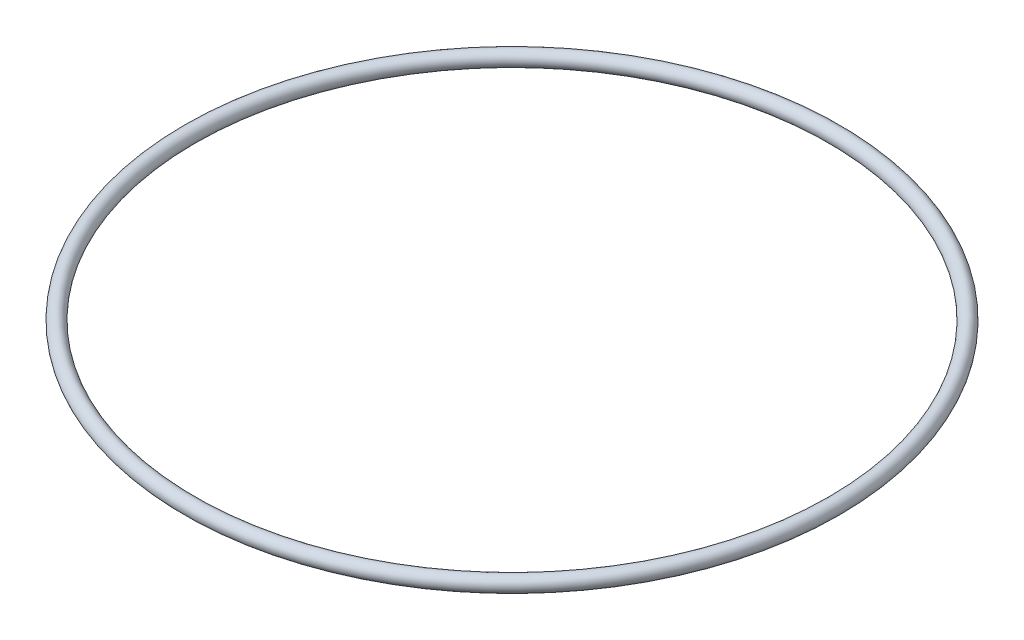
ISO-10303-21;
HEADER;
FILE_DESCRIPTION(('STEP AP214'),'2;1');
FILE_NAME('part.step','',(''),(''),'','','');
FILE_SCHEMA(('AUTOMOTIVE_DESIGN { 1 0 10303 214 1 1 1 1 }'));
ENDSEC;
DATA;
#1=APPLICATION_CONTEXT('core data for automotive mechanical design processes');
#2=APPLICATION_PROTOCOL_DEFINITION('international standard','automotive_design',2000,#1);
#3=PRODUCT_CONTEXT('',#1,'mechanical');
#4=PRODUCT('Part','Part','',(#3));
#5=PRODUCT_RELATED_PRODUCT_CATEGORY('part','',(#4));
#6=PRODUCT_DEFINITION_FORMATION('','',#4);
#7=PRODUCT_DEFINITION_CONTEXT('part definition',#1,'design');
#8=PRODUCT_DEFINITION('design','',#6,#7);
#9=PRODUCT_DEFINITION_SHAPE('','',#8);
#10=(LENGTH_UNIT() NAMED_UNIT(*) SI_UNIT(.MILLI.,.METRE.));
#11=(NAMED_UNIT(*) PLANE_ANGLE_UNIT() SI_UNIT($,.RADIAN.));
#12=(NAMED_UNIT(*) SI_UNIT($,.STERADIAN.) SOLID_ANGLE_UNIT());
#13=UNCERTAINTY_MEASURE_WITH_UNIT(LENGTH_MEASURE(1.E-05),#10,'distance_accuracy_value','');
#14=(GEOMETRIC_REPRESENTATION_CONTEXT(3) GLOBAL_UNCERTAINTY_ASSIGNED_CONTEXT((#13)) GLOBAL_UNIT_ASSIGNED_CONTEXT((#10,
#11,#12)) REPRESENTATION_CONTEXT('',''));
#15=CARTESIAN_POINT('',(0.,0.,0.));
#16=DIRECTION('',(0.,0.,1.));
#17=DIRECTION('',(1.,0.,0.));
#18=AXIS2_PLACEMENT_3D('',#15,#16,#17);
#19=CARTESIAN_POINT('',(0.,0.,0.));
#20=DIRECTION('',(0.,1.,0.));
#21=DIRECTION('',(0.,0.,1.));
#22=AXIS2_PLACEMENT_3D('',#19,#20,#21);
#23=TOROIDAL_SURFACE('',#22,56.3,1.3);
#24=CARTESIAN_POINT('',(-56.3,0.,0.));
#25=DIRECTION('',(0.,0.,1.));
#26=DIRECTION('',(1.,0.,0.));
#27=AXIS2_PLACEMENT_3D('',#24,#25,#26);
#28=CIRCLE('',#27,1.3);
#29=CARTESIAN_POINT('',(-57.6,0.,0.));
#30=VERTEX_POINT('',#29);
#31=EDGE_CURVE('E10',#30,#30,#28,.T.);
#32=CARTESIAN_POINT('',(0.,0.,0.));
#33=DIRECTION('',(0.,1.,0.));
#34=DIRECTION('',(0.,0.,1.));
#35=AXIS2_PLACEMENT_3D('',#32,#33,#34);
#36=CIRCLE('',#35,57.6);
#37=EDGE_CURVE('',#30,#30,#36,.T.);
#38=ORIENTED_EDGE('',*,*,#31,.T.);
#39=ORIENTED_EDGE('',*,*,#31,.F.);
#40=ORIENTED_EDGE('',*,*,#37,.T.);
#41=ORIENTED_EDGE('',*,*,#37,.F.);
#42=EDGE_LOOP('',(#38,#40,#39,#41));
#43=FACE_BOUND('',#42,.T.);
#44=ADVANCED_FACE('F32',(#43),#23,.T.);
#45=CLOSED_SHELL('',(#44));
#46=MANIFOLD_SOLID_BREP('B2',#45);
#47=ADVANCED_BREP_SHAPE_REPRESENTATION('',(#18,#46),#14);
#48=SHAPE_DEFINITION_REPRESENTATION(#9,#47);
ENDSEC;
END-ISO-10303-21;
